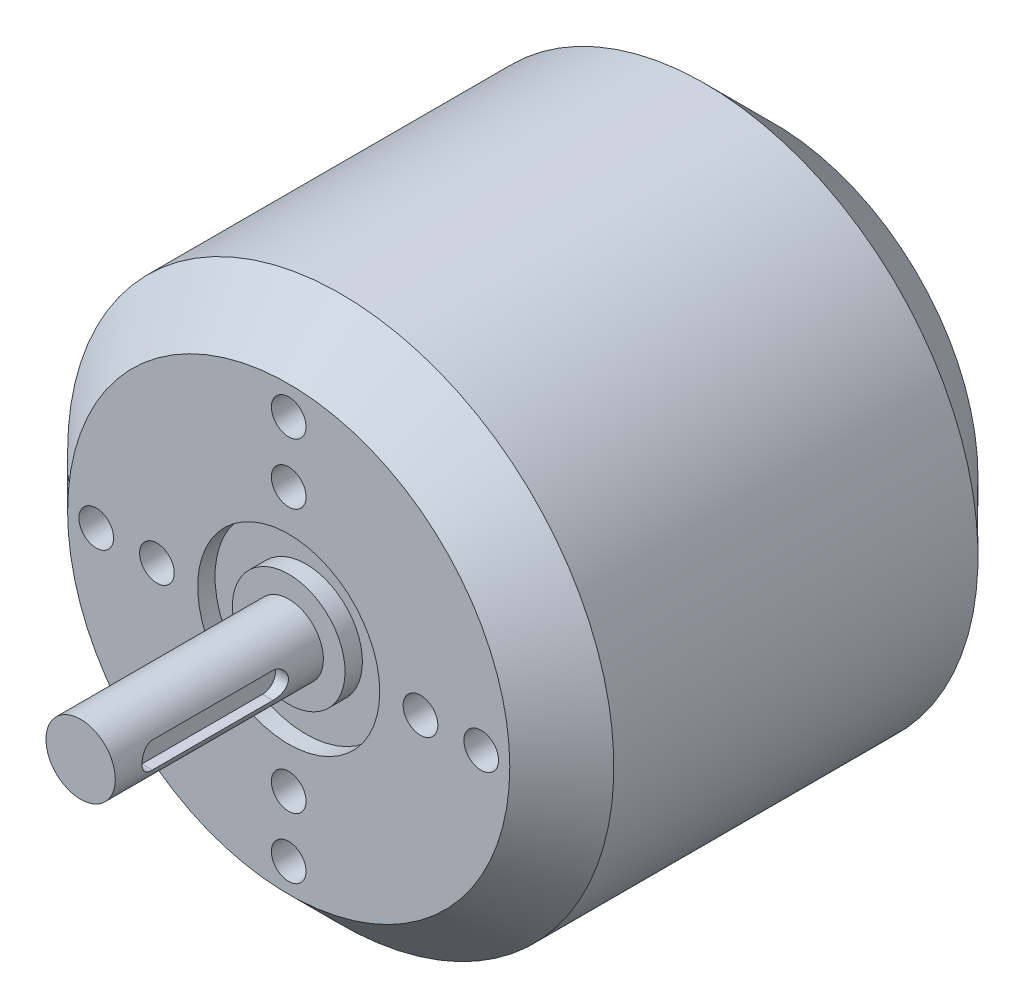
ISO-10303-21;
HEADER;
FILE_DESCRIPTION(('STEP AP214'),'2;1');
FILE_NAME('part.step','',(''),(''),'','','');
FILE_SCHEMA(('AUTOMOTIVE_DESIGN { 1 0 10303 214 1 1 1 1 }'));
ENDSEC;
DATA;
#1=APPLICATION_CONTEXT('core data for automotive mechanical design processes');
#2=APPLICATION_PROTOCOL_DEFINITION('international standard','automotive_design',2000,#1);
#3=PRODUCT_CONTEXT('',#1,'mechanical');
#4=PRODUCT('Part','Part','',(#3));
#5=PRODUCT_RELATED_PRODUCT_CATEGORY('part','',(#4));
#6=PRODUCT_DEFINITION_FORMATION('','',#4);
#7=PRODUCT_DEFINITION_CONTEXT('part definition',#1,'design');
#8=PRODUCT_DEFINITION('design','',#6,#7);
#9=PRODUCT_DEFINITION_SHAPE('','',#8);
#10=(LENGTH_UNIT() NAMED_UNIT(*) SI_UNIT(.MILLI.,.METRE.));
#11=(NAMED_UNIT(*) PLANE_ANGLE_UNIT() SI_UNIT($,.RADIAN.));
#12=(NAMED_UNIT(*) SI_UNIT($,.STERADIAN.) SOLID_ANGLE_UNIT());
#13=UNCERTAINTY_MEASURE_WITH_UNIT(LENGTH_MEASURE(1.E-05),#10,'distance_accuracy_value','');
#14=(GEOMETRIC_REPRESENTATION_CONTEXT(3) GLOBAL_UNCERTAINTY_ASSIGNED_CONTEXT((#13)) GLOBAL_UNIT_ASSIGNED_CONTEXT((#10,
#11,#12)) REPRESENTATION_CONTEXT('',''));
#15=CARTESIAN_POINT('',(0.,0.,0.));
#16=DIRECTION('',(0.,0.,1.));
#17=DIRECTION('',(1.,0.,0.));
#18=AXIS2_PLACEMENT_3D('',#15,#16,#17);
#19=CARTESIAN_POINT('',(0.,0.,42.));
#20=DIRECTION('',(0.,0.,-1.));
#21=DIRECTION('',(-1.,0.,0.));
#22=AXIS2_PLACEMENT_3D('',#19,#20,#21);
#23=CYLINDRICAL_SURFACE('',#22,31.5);
#24=CARTESIAN_POINT('',(0.,0.,0.));
#25=DIRECTION('',(0.,0.,-1.));
#26=DIRECTION('',(-1.,0.,0.));
#27=AXIS2_PLACEMENT_3D('',#24,#25,#26);
#28=CIRCLE('',#27,31.5);
#29=CARTESIAN_POINT('',(-31.5,0.,0.));
#30=VERTEX_POINT('',#29);
#31=EDGE_CURVE('E178',#30,#30,#28,.F.);
#32=CARTESIAN_POINT('',(0.,0.,42.));
#33=DIRECTION('',(0.,0.,1.));
#34=DIRECTION('',(1.,0.,0.));
#35=AXIS2_PLACEMENT_3D('',#32,#33,#34);
#36=CIRCLE('',#35,31.5);
#37=CARTESIAN_POINT('',(-31.5,0.,42.));
#38=VERTEX_POINT('',#37);
#39=EDGE_CURVE('E181',#38,#38,#36,.F.);
#40=CARTESIAN_POINT('',(-31.5,0.,0.));
#41=CARTESIAN_POINT('',(-31.5,0.,0.4375));
#42=CARTESIAN_POINT('',(-31.5,0.,0.875000000000001));
#43=CARTESIAN_POINT('',(-31.5,0.,1.75));
#44=CARTESIAN_POINT('',(-31.5,0.,2.1875));
#45=CARTESIAN_POINT('',(-31.5,0.,3.0625));
#46=CARTESIAN_POINT('',(-31.5,0.,3.5));
#47=CARTESIAN_POINT('',(-31.5,0.,4.375));
#48=CARTESIAN_POINT('',(-31.5,0.,4.8125));
#49=CARTESIAN_POINT('',(-31.5,0.,5.6875));
#50=CARTESIAN_POINT('',(-31.5,0.,6.125));
#51=CARTESIAN_POINT('',(-31.5,0.,7.));
#52=CARTESIAN_POINT('',(-31.5,0.,7.4375));
#53=CARTESIAN_POINT('',(-31.5,0.,8.3125));
#54=CARTESIAN_POINT('',(-31.5,0.,8.75));
#55=CARTESIAN_POINT('',(-31.5,0.,9.625));
#56=CARTESIAN_POINT('',(-31.5,0.,10.0625));
#57=CARTESIAN_POINT('',(-31.5,0.,10.9375));
#58=CARTESIAN_POINT('',(-31.5,0.,11.375));
#59=CARTESIAN_POINT('',(-31.5,0.,12.25));
#60=CARTESIAN_POINT('',(-31.5,0.,12.6875));
#61=CARTESIAN_POINT('',(-31.5,0.,13.5625));
#62=CARTESIAN_POINT('',(-31.5,0.,14.));
#63=CARTESIAN_POINT('',(-31.5,0.,14.875));
#64=CARTESIAN_POINT('',(-31.5,0.,15.3125));
#65=CARTESIAN_POINT('',(-31.5,0.,16.1875));
#66=CARTESIAN_POINT('',(-31.5,0.,16.625));
#67=CARTESIAN_POINT('',(-31.5,0.,17.5));
#68=CARTESIAN_POINT('',(-31.5,0.,17.9375));
#69=CARTESIAN_POINT('',(-31.5,0.,18.8125));
#70=CARTESIAN_POINT('',(-31.5,0.,19.25));
#71=CARTESIAN_POINT('',(-31.5,0.,20.125));
#72=CARTESIAN_POINT('',(-31.5,0.,20.5625));
#73=CARTESIAN_POINT('',(-31.5,0.,21.4375));
#74=CARTESIAN_POINT('',(-31.5,0.,21.875));
#75=CARTESIAN_POINT('',(-31.5,0.,22.75));
#76=CARTESIAN_POINT('',(-31.5,0.,23.1875));
#77=CARTESIAN_POINT('',(-31.5,0.,24.0625));
#78=CARTESIAN_POINT('',(-31.5,0.,24.5));
#79=CARTESIAN_POINT('',(-31.5,0.,25.375));
#80=CARTESIAN_POINT('',(-31.5,0.,25.8125));
#81=CARTESIAN_POINT('',(-31.5,0.,26.6875));
#82=CARTESIAN_POINT('',(-31.5,0.,27.125));
#83=CARTESIAN_POINT('',(-31.5,0.,28.));
#84=CARTESIAN_POINT('',(-31.5,0.,28.4375));
#85=CARTESIAN_POINT('',(-31.5,0.,29.3125));
#86=CARTESIAN_POINT('',(-31.5,0.,29.75));
#87=CARTESIAN_POINT('',(-31.5,0.,30.625));
#88=CARTESIAN_POINT('',(-31.5,0.,31.0625));
#89=CARTESIAN_POINT('',(-31.5,0.,31.9375));
#90=CARTESIAN_POINT('',(-31.5,0.,32.375));
#91=CARTESIAN_POINT('',(-31.5,0.,33.25));
#92=CARTESIAN_POINT('',(-31.5,0.,33.6875));
#93=CARTESIAN_POINT('',(-31.5,0.,34.5625));
#94=CARTESIAN_POINT('',(-31.5,0.,35.));
#95=CARTESIAN_POINT('',(-31.5,0.,35.875));
#96=CARTESIAN_POINT('',(-31.5,0.,36.3125));
#97=CARTESIAN_POINT('',(-31.5,0.,37.1875));
#98=CARTESIAN_POINT('',(-31.5,0.,37.625));
#99=CARTESIAN_POINT('',(-31.5,0.,38.5));
#100=CARTESIAN_POINT('',(-31.5,0.,38.9375));
#101=CARTESIAN_POINT('',(-31.5,0.,39.8125));
#102=CARTESIAN_POINT('',(-31.5,0.,40.25));
#103=CARTESIAN_POINT('',(-31.5,0.,41.125));
#104=CARTESIAN_POINT('',(-31.5,0.,41.5625));
#105=CARTESIAN_POINT('',(-31.5,0.,42.));
#106=B_SPLINE_CURVE_WITH_KNOTS('',3,(#40,#41,#42,#43,#44,#45,#46,#47,#48,#49,#50,#51,#52,#53,
#54,#55,#56,#57,#58,#59,#60,#61,#62,#63,#64,#65,#66,#67,#68,#69,#70,#71,#72,#73,#74,#75,#76,#77,
#78,#79,#80,#81,#82,#83,#84,#85,#86,#87,#88,#89,#90,#91,#92,#93,#94,#95,#96,#97,#98,#99,#100,
#101,#102,#103,#104,#105),.UNSPECIFIED.,.F.,.F.,(4,2,2,2,2,2,2,2,2,2,2,2,2,2,2,2,2,2,2,2,2,2,2,
2,2,2,2,2,2,2,2,2,4),(0.,1.3125,2.625,3.9375,5.25,6.5625,7.875,9.1875,10.5,11.8125,13.125,
14.4375,15.75,17.0625,18.375,19.6875,21.,22.3125,23.625,24.9375,26.25,27.5625,28.875,30.1875,
31.5,32.8125,34.125,35.4375,36.75,38.0625,39.375,40.6875,42.),.UNSPECIFIED.);
#107=EDGE_CURVE('BSEAM38',#30,#38,#106,.T.);
#108=ORIENTED_EDGE('',*,*,#31,.T.);
#109=ORIENTED_EDGE('',*,*,#39,.T.);
#110=ORIENTED_EDGE('',*,*,#107,.T.);
#111=ORIENTED_EDGE('',*,*,#107,.F.);
#112=EDGE_LOOP('',(#108,#110,#109,#111));
#113=FACE_BOUND('',#112,.T.);
#114=ADVANCED_FACE('F38',(#113),#23,.T.);
#115=CARTESIAN_POINT('',(0.,0.,48.));
#116=DIRECTION('',(0.,0.,1.));
#117=DIRECTION('',(1.,0.,0.));
#118=AXIS2_PLACEMENT_3D('',#115,#116,#117);
#119=PLANE('',#118);
#120=CARTESIAN_POINT('',(0.,0.,48.));
#121=DIRECTION('',(0.,0.,1.));
#122=DIRECTION('',(1.,0.,0.));
#123=AXIS2_PLACEMENT_3D('',#120,#121,#122);
#124=CIRCLE('',#123,10.5);
#125=CARTESIAN_POINT('',(10.5,0.,48.));
#126=VERTEX_POINT('',#125);
#127=EDGE_CURVE('E107',#126,#126,#124,.T.);
#128=ORIENTED_EDGE('',*,*,#127,.F.);
#129=EDGE_LOOP('',(#128));
#130=FACE_BOUND('',#129,.T.);
#131=CARTESIAN_POINT('',(2.10232574252353E-12,-15.2,48.));
#132=DIRECTION('',(0.,0.,1.));
#133=DIRECTION('',(1.,0.,0.));
#134=AXIS2_PLACEMENT_3D('',#131,#132,#133);
#135=CIRCLE('',#134,2.00000000000211);
#136=CARTESIAN_POINT('',(2.00000000000421,-15.2,48.));
#137=VERTEX_POINT('',#136);
#138=EDGE_CURVE('E120',#137,#137,#135,.T.);
#139=ORIENTED_EDGE('',*,*,#138,.F.);
#140=EDGE_LOOP('',(#139));
#141=FACE_BOUND('',#140,.T.);
#142=CARTESIAN_POINT('',(22.200000000001,1.05159149764147E-12,48.));
#143=DIRECTION('',(0.,0.,1.));
#144=DIRECTION('',(1.,0.,0.));
#145=AXIS2_PLACEMENT_3D('',#142,#143,#144);
#146=CIRCLE('',#145,2.00000000000077);
#147=CARTESIAN_POINT('',(24.2000000000018,1.05159149764147E-12,48.));
#148=VERTEX_POINT('',#147);
#149=EDGE_CURVE('E139',#148,#148,#146,.T.);
#150=ORIENTED_EDGE('',*,*,#149,.F.);
#151=EDGE_LOOP('',(#150));
#152=FACE_BOUND('',#151,.T.);
#153=CARTESIAN_POINT('',(15.2000000000011,1.05116287126176E-12,48.));
#154=DIRECTION('',(0.,0.,1.));
#155=DIRECTION('',(1.,0.,0.));
#156=AXIS2_PLACEMENT_3D('',#153,#154,#155);
#157=CIRCLE('',#156,2.00000000000075);
#158=CARTESIAN_POINT('',(17.2000000000018,1.05116287126176E-12,48.));
#159=VERTEX_POINT('',#158);
#160=EDGE_CURVE('E138',#159,#159,#157,.T.);
#161=ORIENTED_EDGE('',*,*,#160,.F.);
#162=EDGE_LOOP('',(#161));
#163=FACE_BOUND('',#162,.T.);
#164=CARTESIAN_POINT('',(0.,22.2,48.));
#165=DIRECTION('',(0.,0.,1.));
#166=DIRECTION('',(1.,0.,0.));
#167=AXIS2_PLACEMENT_3D('',#164,#165,#166);
#168=CIRCLE('',#167,2.);
#169=CARTESIAN_POINT('',(2.,22.2,48.));
#170=VERTEX_POINT('',#169);
#171=EDGE_CURVE('E151',#170,#170,#168,.T.);
#172=ORIENTED_EDGE('',*,*,#171,.F.);
#173=EDGE_LOOP('',(#172));
#174=FACE_BOUND('',#173,.T.);
#175=CARTESIAN_POINT('',(2.10318299528293E-12,-22.2,48.));
#176=DIRECTION('',(0.,0.,1.));
#177=DIRECTION('',(1.,0.,0.));
#178=AXIS2_PLACEMENT_3D('',#175,#176,#177);
#179=CIRCLE('',#178,2.00000000000216);
#180=CARTESIAN_POINT('',(2.00000000000426,-22.2,48.));
#181=VERTEX_POINT('',#180);
#182=EDGE_CURVE('E121',#181,#181,#179,.T.);
#183=ORIENTED_EDGE('',*,*,#182,.F.);
#184=EDGE_LOOP('',(#183));
#185=FACE_BOUND('',#184,.T.);
#186=CARTESIAN_POINT('',(-15.199999999999,-1.05302433439647E-12,48.));
#187=DIRECTION('',(0.,0.,1.));
#188=DIRECTION('',(1.,0.,0.));
#189=AXIS2_PLACEMENT_3D('',#186,#187,#188);
#190=CIRCLE('',#189,2.00000000000147);
#191=CARTESIAN_POINT('',(-13.1999999999975,-1.05302433439647E-12,48.));
#192=VERTEX_POINT('',#191);
#193=EDGE_CURVE('E127',#192,#192,#190,.T.);
#194=ORIENTED_EDGE('',*,*,#193,.F.);
#195=EDGE_LOOP('',(#194));
#196=FACE_BOUND('',#195,.T.);
#197=CARTESIAN_POINT('',(-22.199999999999,-1.05431021353557E-12,48.));
#198=DIRECTION('',(0.,0.,1.));
#199=DIRECTION('',(1.,0.,0.));
#200=AXIS2_PLACEMENT_3D('',#197,#198,#199);
#201=CIRCLE('',#200,2.00000000000154);
#202=CARTESIAN_POINT('',(-20.1999999999974,-1.05431021353557E-12,48.));
#203=VERTEX_POINT('',#202);
#204=EDGE_CURVE('E89',#203,#203,#201,.T.);
#205=ORIENTED_EDGE('',*,*,#204,.F.);
#206=EDGE_LOOP('',(#205));
#207=FACE_BOUND('',#206,.T.);
#208=CARTESIAN_POINT('',(0.,15.2,48.));
#209=DIRECTION('',(0.,0.,1.));
#210=DIRECTION('',(1.,0.,0.));
#211=AXIS2_PLACEMENT_3D('',#208,#209,#210);
#212=CIRCLE('',#211,2.);
#213=CARTESIAN_POINT('',(2.,15.2,48.));
#214=VERTEX_POINT('',#213);
#215=EDGE_CURVE('E150',#214,#214,#212,.T.);
#216=ORIENTED_EDGE('',*,*,#215,.F.);
#217=EDGE_LOOP('',(#216));
#218=FACE_BOUND('',#217,.T.);
#219=CARTESIAN_POINT('',(0.,0.,48.));
#220=DIRECTION('',(0.,0.,1.));
#221=DIRECTION('',(1.,0.,0.));
#222=AXIS2_PLACEMENT_3D('',#219,#220,#221);
#223=CIRCLE('',#222,25.5);
#224=CARTESIAN_POINT('',(25.5,0.,48.));
#225=VERTEX_POINT('',#224);
#226=EDGE_CURVE('E175',#225,#225,#223,.T.);
#227=ORIENTED_EDGE('',*,*,#226,.T.);
#228=EDGE_LOOP('',(#227));
#229=FACE_BOUND('',#228,.T.);
#230=ADVANCED_FACE('F286',(#130,#141,#152,#163,#174,#185,#196,#207,#218,#229),#119,.T.);
#231=CARTESIAN_POINT('',(0.,0.,48.));
#232=DIRECTION('',(0.,0.,-1.));
#233=DIRECTION('',(-1.,0.,0.));
#234=AXIS2_PLACEMENT_3D('',#231,#232,#233);
#235=CONICAL_SURFACE('',#234,25.5,0.785398163397448);
#236=ORIENTED_EDGE('',*,*,#39,.F.);
#237=EDGE_LOOP('',(#236));
#238=FACE_BOUND('',#237,.T.);
#239=ORIENTED_EDGE('',*,*,#226,.F.);
#240=EDGE_LOOP('',(#239));
#241=FACE_BOUND('',#240,.T.);
#242=ADVANCED_FACE('F292',(#238,#241),#235,.T.);
#243=CARTESIAN_POINT('',(0.,0.,-8.));
#244=DIRECTION('',(0.,0.,-1.));
#245=DIRECTION('',(-1.,0.,0.));
#246=AXIS2_PLACEMENT_3D('',#243,#244,#245);
#247=PLANE('',#246);
#248=CARTESIAN_POINT('',(0.,0.,-8.));
#249=DIRECTION('',(0.,0.,-1.));
#250=DIRECTION('',(-1.,0.,0.));
#251=AXIS2_PLACEMENT_3D('',#248,#249,#250);
#252=CIRCLE('',#251,7.5);
#253=CARTESIAN_POINT('',(-7.5,0.,-8.));
#254=VERTEX_POINT('',#253);
#255=EDGE_CURVE('E172',#254,#254,#252,.T.);
#256=ORIENTED_EDGE('',*,*,#255,.F.);
#257=EDGE_LOOP('',(#256));
#258=FACE_BOUND('',#257,.T.);
#259=CARTESIAN_POINT('',(0.,0.,-8.));
#260=DIRECTION('',(0.,0.,-1.));
#261=DIRECTION('',(-1.,0.,0.));
#262=AXIS2_PLACEMENT_3D('',#259,#260,#261);
#263=CIRCLE('',#262,23.5);
#264=CARTESIAN_POINT('',(-23.5,0.,-8.));
#265=VERTEX_POINT('',#264);
#266=EDGE_CURVE('E184',#265,#265,#263,.T.);
#267=ORIENTED_EDGE('',*,*,#266,.T.);
#268=EDGE_LOOP('',(#267));
#269=FACE_BOUND('',#268,.T.);
#270=ADVANCED_FACE('F298',(#258,#269),#247,.T.);
#271=CARTESIAN_POINT('',(0.,0.,-8.));
#272=DIRECTION('',(0.,0.,1.));
#273=DIRECTION('',(1.,0.,0.));
#274=AXIS2_PLACEMENT_3D('',#271,#272,#273);
#275=CONICAL_SURFACE('',#274,23.5,0.785398163397448);
#276=ORIENTED_EDGE('',*,*,#31,.F.);
#277=EDGE_LOOP('',(#276));
#278=FACE_BOUND('',#277,.T.);
#279=ORIENTED_EDGE('',*,*,#266,.F.);
#280=EDGE_LOOP('',(#279));
#281=FACE_BOUND('',#280,.T.);
#282=ADVANCED_FACE('F40',(#278,#281),#275,.T.);
#283=CARTESIAN_POINT('',(0.,0.,-9.));
#284=DIRECTION('',(0.,0.,1.));
#285=DIRECTION('',(1.,0.,0.));
#286=AXIS2_PLACEMENT_3D('',#283,#284,#285);
#287=CYLINDRICAL_SURFACE('',#286,7.5);
#288=CARTESIAN_POINT('',(0.,0.,-9.));
#289=DIRECTION('',(0.,0.,-1.));
#290=DIRECTION('',(-1.,0.,0.));
#291=AXIS2_PLACEMENT_3D('',#288,#289,#290);
#292=CIRCLE('',#291,7.5);
#293=CARTESIAN_POINT('',(-7.5,0.,-9.));
#294=VERTEX_POINT('',#293);
#295=EDGE_CURVE('E167',#294,#294,#292,.T.);
#296=ORIENTED_EDGE('',*,*,#295,.F.);
#297=EDGE_LOOP('',(#296));
#298=FACE_BOUND('',#297,.T.);
#299=ORIENTED_EDGE('',*,*,#255,.T.);
#300=EDGE_LOOP('',(#299));
#301=FACE_BOUND('',#300,.T.);
#302=ADVANCED_FACE('F311',(#298,#301),#287,.T.);
#303=CARTESIAN_POINT('',(0.,0.,-9.));
#304=DIRECTION('',(0.,0.,-1.));
#305=DIRECTION('',(-1.,0.,0.));
#306=AXIS2_PLACEMENT_3D('',#303,#304,#305);
#307=PLANE('',#306);
#308=ORIENTED_EDGE('',*,*,#295,.T.);
#309=EDGE_LOOP('',(#308));
#310=FACE_BOUND('',#309,.T.);
#311=ADVANCED_FACE('F276',(#310),#307,.T.);
#312=CARTESIAN_POINT('',(0.,15.2,40.));
#313=DIRECTION('',(0.,0.,1.));
#314=DIRECTION('',(1.,0.,0.));
#315=AXIS2_PLACEMENT_3D('',#312,#313,#314);
#316=CYLINDRICAL_SURFACE('',#315,2.);
#317=CARTESIAN_POINT('',(0.,15.2,40.));
#318=DIRECTION('',(0.,0.,1.));
#319=DIRECTION('',(1.,0.,0.));
#320=AXIS2_PLACEMENT_3D('',#317,#318,#319);
#321=CIRCLE('',#320,2.);
#322=CARTESIAN_POINT('',(2.,15.2,40.));
#323=VERTEX_POINT('',#322);
#324=EDGE_CURVE('E159',#323,#323,#321,.T.);
#325=ORIENTED_EDGE('',*,*,#324,.F.);
#326=EDGE_LOOP('',(#325));
#327=FACE_BOUND('',#326,.T.);
#328=ORIENTED_EDGE('',*,*,#215,.T.);
#329=EDGE_LOOP('',(#328));
#330=FACE_BOUND('',#329,.T.);
#331=ADVANCED_FACE('F273',(#327,#330),#316,.F.);
#332=CARTESIAN_POINT('',(0.,15.2,40.));
#333=DIRECTION('',(0.,0.,1.));
#334=DIRECTION('',(1.,0.,0.));
#335=AXIS2_PLACEMENT_3D('',#332,#333,#334);
#336=PLANE('',#335);
#337=ORIENTED_EDGE('',*,*,#324,.T.);
#338=EDGE_LOOP('',(#337));
#339=FACE_BOUND('',#338,.T.);
#340=ADVANCED_FACE('F237',(#339),#336,.T.);
#341=CARTESIAN_POINT('',(-22.199999999999,-1.05431021353557E-12,40.));
#342=DIRECTION('',(0.,0.,1.));
#343=DIRECTION('',(1.,0.,0.));
#344=AXIS2_PLACEMENT_3D('',#341,#342,#343);
#345=CYLINDRICAL_SURFACE('',#344,2.00000000000154);
#346=CARTESIAN_POINT('',(-22.199999999999,-1.05431021353557E-12,40.));
#347=DIRECTION('',(0.,0.,1.));
#348=DIRECTION('',(1.,0.,0.));
#349=AXIS2_PLACEMENT_3D('',#346,#347,#348);
#350=CIRCLE('',#349,2.00000000000154);
#351=CARTESIAN_POINT('',(-20.1999999999974,-1.05431021353557E-12,40.));
#352=VERTEX_POINT('',#351);
#353=EDGE_CURVE('E130',#352,#352,#350,.T.);
#354=ORIENTED_EDGE('',*,*,#353,.F.);
#355=EDGE_LOOP('',(#354));
#356=FACE_BOUND('',#355,.T.);
#357=ORIENTED_EDGE('',*,*,#204,.T.);
#358=EDGE_LOOP('',(#357));
#359=FACE_BOUND('',#358,.T.);
#360=ADVANCED_FACE('F233',(#356,#359),#345,.F.);
#361=CARTESIAN_POINT('',(-22.199999999999,-1.05431021353557E-12,40.));
#362=DIRECTION('',(0.,0.,1.));
#363=DIRECTION('',(1.,0.,0.));
#364=AXIS2_PLACEMENT_3D('',#361,#362,#363);
#365=PLANE('',#364);
#366=ORIENTED_EDGE('',*,*,#353,.T.);
#367=EDGE_LOOP('',(#366));
#368=FACE_BOUND('',#367,.T.);
#369=ADVANCED_FACE('F229',(#368),#365,.T.);
#370=CARTESIAN_POINT('',(-15.199999999999,-1.05302433439647E-12,40.));
#371=DIRECTION('',(0.,0.,1.));
#372=DIRECTION('',(1.,0.,0.));
#373=AXIS2_PLACEMENT_3D('',#370,#371,#372);
#374=CYLINDRICAL_SURFACE('',#373,2.00000000000147);
#375=CARTESIAN_POINT('',(-15.199999999999,-1.05302433439647E-12,40.));
#376=DIRECTION('',(0.,0.,1.));
#377=DIRECTION('',(1.,0.,0.));
#378=AXIS2_PLACEMENT_3D('',#375,#376,#377);
#379=CIRCLE('',#378,2.00000000000147);
#380=CARTESIAN_POINT('',(-13.1999999999975,-1.05302433439647E-12,40.));
#381=VERTEX_POINT('',#380);
#382=EDGE_CURVE('E124',#381,#381,#379,.T.);
#383=ORIENTED_EDGE('',*,*,#382,.F.);
#384=EDGE_LOOP('',(#383));
#385=FACE_BOUND('',#384,.T.);
#386=ORIENTED_EDGE('',*,*,#193,.T.);
#387=EDGE_LOOP('',(#386));
#388=FACE_BOUND('',#387,.T.);
#389=ADVANCED_FACE('F225',(#385,#388),#374,.F.);
#390=CARTESIAN_POINT('',(-15.199999999999,-1.05302433439647E-12,40.));
#391=DIRECTION('',(0.,0.,1.));
#392=DIRECTION('',(1.,0.,0.));
#393=AXIS2_PLACEMENT_3D('',#390,#391,#392);
#394=PLANE('',#393);
#395=ORIENTED_EDGE('',*,*,#382,.T.);
#396=EDGE_LOOP('',(#395));
#397=FACE_BOUND('',#396,.T.);
#398=ADVANCED_FACE('F221',(#397),#394,.T.);
#399=CARTESIAN_POINT('',(2.10318299528293E-12,-22.2,40.));
#400=DIRECTION('',(0.,0.,1.));
#401=DIRECTION('',(1.,0.,0.));
#402=AXIS2_PLACEMENT_3D('',#399,#400,#401);
#403=CYLINDRICAL_SURFACE('',#402,2.00000000000216);
#404=CARTESIAN_POINT('',(2.10318299528293E-12,-22.2,40.));
#405=DIRECTION('',(0.,0.,1.));
#406=DIRECTION('',(1.,0.,0.));
#407=AXIS2_PLACEMENT_3D('',#404,#405,#406);
#408=CIRCLE('',#407,2.00000000000216);
#409=CARTESIAN_POINT('',(2.00000000000426,-22.2,40.));
#410=VERTEX_POINT('',#409);
#411=EDGE_CURVE('E117',#410,#410,#408,.T.);
#412=ORIENTED_EDGE('',*,*,#411,.F.);
#413=EDGE_LOOP('',(#412));
#414=FACE_BOUND('',#413,.T.);
#415=ORIENTED_EDGE('',*,*,#182,.T.);
#416=EDGE_LOOP('',(#415));
#417=FACE_BOUND('',#416,.T.);
#418=ADVANCED_FACE('F217',(#414,#417),#403,.F.);
#419=CARTESIAN_POINT('',(2.10318299528293E-12,-22.2,40.));
#420=DIRECTION('',(0.,0.,1.));
#421=DIRECTION('',(1.,0.,0.));
#422=AXIS2_PLACEMENT_3D('',#419,#420,#421);
#423=PLANE('',#422);
#424=ORIENTED_EDGE('',*,*,#411,.T.);
#425=EDGE_LOOP('',(#424));
#426=FACE_BOUND('',#425,.T.);
#427=ADVANCED_FACE('F213',(#426),#423,.T.);
#428=CARTESIAN_POINT('',(0.,22.2,40.));
#429=DIRECTION('',(0.,0.,1.));
#430=DIRECTION('',(1.,0.,0.));
#431=AXIS2_PLACEMENT_3D('',#428,#429,#430);
#432=CYLINDRICAL_SURFACE('',#431,2.);
#433=CARTESIAN_POINT('',(0.,22.2,40.));
#434=DIRECTION('',(0.,0.,1.));
#435=DIRECTION('',(1.,0.,0.));
#436=AXIS2_PLACEMENT_3D('',#433,#434,#435);
#437=CIRCLE('',#436,2.);
#438=CARTESIAN_POINT('',(2.,22.2,40.));
#439=VERTEX_POINT('',#438);
#440=EDGE_CURVE('E147',#439,#439,#437,.T.);
#441=ORIENTED_EDGE('',*,*,#440,.F.);
#442=EDGE_LOOP('',(#441));
#443=FACE_BOUND('',#442,.T.);
#444=ORIENTED_EDGE('',*,*,#171,.T.);
#445=EDGE_LOOP('',(#444));
#446=FACE_BOUND('',#445,.T.);
#447=ADVANCED_FACE('F216',(#443,#446),#432,.F.);
#448=CARTESIAN_POINT('',(0.,22.2,40.));
#449=DIRECTION('',(0.,0.,1.));
#450=DIRECTION('',(1.,0.,0.));
#451=AXIS2_PLACEMENT_3D('',#448,#449,#450);
#452=PLANE('',#451);
#453=ORIENTED_EDGE('',*,*,#440,.T.);
#454=EDGE_LOOP('',(#453));
#455=FACE_BOUND('',#454,.T.);
#456=ADVANCED_FACE('F257',(#455),#452,.T.);
#457=CARTESIAN_POINT('',(15.2000000000011,1.05116287126176E-12,40.));
#458=DIRECTION('',(0.,0.,1.));
#459=DIRECTION('',(1.,0.,0.));
#460=AXIS2_PLACEMENT_3D('',#457,#458,#459);
#461=CYLINDRICAL_SURFACE('',#460,2.00000000000075);
#462=CARTESIAN_POINT('',(15.2000000000011,1.05116287126176E-12,40.));
#463=DIRECTION('',(0.,0.,1.));
#464=DIRECTION('',(1.,0.,0.));
#465=AXIS2_PLACEMENT_3D('',#462,#463,#464);
#466=CIRCLE('',#465,2.00000000000075);
#467=CARTESIAN_POINT('',(17.2000000000018,1.05116287126176E-12,40.));
#468=VERTEX_POINT('',#467);
#469=EDGE_CURVE('E154',#468,#468,#466,.T.);
#470=ORIENTED_EDGE('',*,*,#469,.F.);
#471=EDGE_LOOP('',(#470));
#472=FACE_BOUND('',#471,.T.);
#473=ORIENTED_EDGE('',*,*,#160,.T.);
#474=EDGE_LOOP('',(#473));
#475=FACE_BOUND('',#474,.T.);
#476=ADVANCED_FACE('F260',(#472,#475),#461,.F.);
#477=CARTESIAN_POINT('',(15.2000000000011,1.05116287126176E-12,40.));
#478=DIRECTION('',(0.,0.,1.));
#479=DIRECTION('',(1.,0.,0.));
#480=AXIS2_PLACEMENT_3D('',#477,#478,#479);
#481=PLANE('',#480);
#482=ORIENTED_EDGE('',*,*,#469,.T.);
#483=EDGE_LOOP('',(#482));
#484=FACE_BOUND('',#483,.T.);
#485=ADVANCED_FACE('F247',(#484),#481,.T.);
#486=CARTESIAN_POINT('',(22.200000000001,1.05159149764147E-12,40.));
#487=DIRECTION('',(0.,0.,1.));
#488=DIRECTION('',(1.,0.,0.));
#489=AXIS2_PLACEMENT_3D('',#486,#487,#488);
#490=CYLINDRICAL_SURFACE('',#489,2.00000000000077);
#491=CARTESIAN_POINT('',(22.200000000001,1.05159149764147E-12,40.));
#492=DIRECTION('',(0.,0.,1.));
#493=DIRECTION('',(1.,0.,0.));
#494=AXIS2_PLACEMENT_3D('',#491,#492,#493);
#495=CIRCLE('',#494,2.00000000000077);
#496=CARTESIAN_POINT('',(24.2000000000018,1.05159149764147E-12,40.));
#497=VERTEX_POINT('',#496);
#498=EDGE_CURVE('E135',#497,#497,#495,.T.);
#499=ORIENTED_EDGE('',*,*,#498,.F.);
#500=EDGE_LOOP('',(#499));
#501=FACE_BOUND('',#500,.T.);
#502=ORIENTED_EDGE('',*,*,#149,.T.);
#503=EDGE_LOOP('',(#502));
#504=FACE_BOUND('',#503,.T.);
#505=ADVANCED_FACE('F243',(#501,#504),#490,.F.);
#506=CARTESIAN_POINT('',(22.200000000001,1.05159149764147E-12,40.));
#507=DIRECTION('',(0.,0.,1.));
#508=DIRECTION('',(1.,0.,0.));
#509=AXIS2_PLACEMENT_3D('',#506,#507,#508);
#510=PLANE('',#509);
#511=ORIENTED_EDGE('',*,*,#498,.T.);
#512=EDGE_LOOP('',(#511));
#513=FACE_BOUND('',#512,.T.);
#514=ADVANCED_FACE('F239',(#513),#510,.T.);
#515=CARTESIAN_POINT('',(2.10232574252353E-12,-15.2,40.));
#516=DIRECTION('',(0.,0.,1.));
#517=DIRECTION('',(1.,0.,0.));
#518=AXIS2_PLACEMENT_3D('',#515,#516,#517);
#519=CYLINDRICAL_SURFACE('',#518,2.00000000000211);
#520=CARTESIAN_POINT('',(2.10232574252353E-12,-15.2,40.));
#521=DIRECTION('',(0.,0.,1.));
#522=DIRECTION('',(1.,0.,0.));
#523=AXIS2_PLACEMENT_3D('',#520,#521,#522);
#524=CIRCLE('',#523,2.00000000000211);
#525=CARTESIAN_POINT('',(2.00000000000421,-15.2,40.));
#526=VERTEX_POINT('',#525);
#527=EDGE_CURVE('E142',#526,#526,#524,.T.);
#528=ORIENTED_EDGE('',*,*,#527,.F.);
#529=EDGE_LOOP('',(#528));
#530=FACE_BOUND('',#529,.T.);
#531=ORIENTED_EDGE('',*,*,#138,.T.);
#532=EDGE_LOOP('',(#531));
#533=FACE_BOUND('',#532,.T.);
#534=ADVANCED_FACE('F242',(#530,#533),#519,.F.);
#535=CARTESIAN_POINT('',(2.10232574252353E-12,-15.2,40.));
#536=DIRECTION('',(0.,0.,1.));
#537=DIRECTION('',(1.,0.,0.));
#538=AXIS2_PLACEMENT_3D('',#535,#536,#537);
#539=PLANE('',#538);
#540=ORIENTED_EDGE('',*,*,#527,.T.);
#541=EDGE_LOOP('',(#540));
#542=FACE_BOUND('',#541,.T.);
#543=ADVANCED_FACE('F249',(#542),#539,.T.);
#544=CARTESIAN_POINT('',(0.,0.,46.));
#545=DIRECTION('',(0.,0.,1.));
#546=DIRECTION('',(1.,0.,0.));
#547=AXIS2_PLACEMENT_3D('',#544,#545,#546);
#548=CYLINDRICAL_SURFACE('',#547,10.5);
#549=CARTESIAN_POINT('',(0.,0.,46.));
#550=DIRECTION('',(0.,0.,1.));
#551=DIRECTION('',(1.,0.,0.));
#552=AXIS2_PLACEMENT_3D('',#549,#550,#551);
#553=CIRCLE('',#552,10.5);
#554=CARTESIAN_POINT('',(10.5,0.,46.));
#555=VERTEX_POINT('',#554);
#556=EDGE_CURVE('E104',#555,#555,#553,.T.);
#557=ORIENTED_EDGE('',*,*,#556,.F.);
#558=EDGE_LOOP('',(#557));
#559=FACE_BOUND('',#558,.T.);
#560=ORIENTED_EDGE('',*,*,#127,.T.);
#561=EDGE_LOOP('',(#560));
#562=FACE_BOUND('',#561,.T.);
#563=ADVANCED_FACE('F252',(#559,#562),#548,.F.);
#564=CARTESIAN_POINT('',(0.,0.,46.));
#565=DIRECTION('',(0.,0.,1.));
#566=DIRECTION('',(1.,0.,0.));
#567=AXIS2_PLACEMENT_3D('',#564,#565,#566);
#568=PLANE('',#567);
#569=CARTESIAN_POINT('',(0.,0.,46.));
#570=DIRECTION('',(0.,0.,1.));
#571=DIRECTION('',(1.,0.,0.));
#572=AXIS2_PLACEMENT_3D('',#569,#570,#571);
#573=CIRCLE('',#572,6.5);
#574=CARTESIAN_POINT('',(6.5,0.,46.));
#575=VERTEX_POINT('',#574);
#576=EDGE_CURVE('E601',#575,#575,#573,.T.);
#577=ORIENTED_EDGE('',*,*,#576,.F.);
#578=EDGE_LOOP('',(#577));
#579=FACE_BOUND('',#578,.T.);
#580=ORIENTED_EDGE('',*,*,#556,.T.);
#581=EDGE_LOOP('',(#580));
#582=FACE_BOUND('',#581,.T.);
#583=ADVANCED_FACE('F397',(#579,#582),#568,.T.);
#584=CARTESIAN_POINT('',(0.,0.,46.));
#585=DIRECTION('',(0.,0.,1.));
#586=DIRECTION('',(1.,0.,0.));
#587=AXIS2_PLACEMENT_3D('',#584,#585,#586);
#588=CYLINDRICAL_SURFACE('',#587,6.5);
#589=ORIENTED_EDGE('',*,*,#576,.T.);
#590=EDGE_LOOP('',(#589));
#591=FACE_BOUND('',#590,.T.);
#592=CARTESIAN_POINT('',(0.,0.,48.));
#593=DIRECTION('',(0.,0.,1.));
#594=DIRECTION('',(1.,0.,0.));
#595=AXIS2_PLACEMENT_3D('',#592,#593,#594);
#596=CIRCLE('',#595,6.5);
#597=CARTESIAN_POINT('',(6.5,0.,48.));
#598=VERTEX_POINT('',#597);
#599=EDGE_CURVE('E599',#598,#598,#596,.T.);
#600=ORIENTED_EDGE('',*,*,#599,.F.);
#601=EDGE_LOOP('',(#600));
#602=FACE_BOUND('',#601,.T.);
#603=ADVANCED_FACE('F406',(#591,#602),#588,.T.);
#604=CARTESIAN_POINT('',(2.5,0.,67.4185376928396));
#605=DIRECTION('',(1.,0.,0.));
#606=DIRECTION('',(0.,0.,-1.));
#607=AXIS2_PLACEMENT_3D('',#604,#605,#606);
#608=PLANE('',#607);
#609=CARTESIAN_POINT('',(2.5,0.,67.4185376928396));
#610=DIRECTION('',(1.,0.,0.));
#611=DIRECTION('',(0.,0.,-1.));
#612=AXIS2_PLACEMENT_3D('',#609,#610,#611);
#613=CIRCLE('',#612,1.5);
#614=CARTESIAN_POINT('',(2.5,1.5,67.4185376928396));
#615=VERTEX_POINT('',#614);
#616=CARTESIAN_POINT('',(2.5,-1.5,67.4185376928396));
#617=VERTEX_POINT('',#616);
#618=EDGE_CURVE('E86',#615,#617,#613,.T.);
#619=ORIENTED_EDGE('',*,*,#618,.T.);
#620=DIRECTION('',(0.,0.,-1.));
#621=VECTOR('',#620,1.);
#622=CARTESIAN_POINT('',(2.5,-1.5,67.4185376928396));
#623=LINE('',#622,#621);
#624=CARTESIAN_POINT('',(2.5,-1.5,53.5270847484594));
#625=VERTEX_POINT('',#624);
#626=EDGE_CURVE('E93',#617,#625,#623,.T.);
#627=ORIENTED_EDGE('',*,*,#626,.T.);
#628=CARTESIAN_POINT('',(2.5,0.,53.5270847484594));
#629=DIRECTION('',(1.,0.,0.));
#630=DIRECTION('',(0.,0.,-1.));
#631=AXIS2_PLACEMENT_3D('',#628,#629,#630);
#632=CIRCLE('',#631,1.5);
#633=CARTESIAN_POINT('',(2.5,1.5,53.5270847484594));
#634=VERTEX_POINT('',#633);
#635=EDGE_CURVE('E99',#625,#634,#632,.T.);
#636=ORIENTED_EDGE('',*,*,#635,.T.);
#637=DIRECTION('',(0.,0.,1.));
#638=VECTOR('',#637,1.);
#639=CARTESIAN_POINT('',(2.5,1.5,67.4185376928396));
#640=LINE('',#639,#638);
#641=EDGE_CURVE('E103',#634,#615,#640,.T.);
#642=ORIENTED_EDGE('',*,*,#641,.T.);
#643=EDGE_LOOP('',(#619,#627,#636,#642));
#644=FACE_BOUND('',#643,.T.);
#645=ADVANCED_FACE('F102',(#644),#608,.T.);
#646=CARTESIAN_POINT('',(12.5,-1.5,67.4185376928396));
#647=DIRECTION('',(0.,1.,0.));
#648=DIRECTION('',(0.,0.,1.));
#649=AXIS2_PLACEMENT_3D('',#646,#647,#648);
#650=PLANE('',#649);
#651=DIRECTION('',(0.,0.,-1.));
#652=VECTOR('',#651,1.);
#653=CARTESIAN_POINT('',(3.70809924354783,-1.5,72.));
#654=LINE('',#653,#652);
#655=CARTESIAN_POINT('',(3.70809924354783,-1.5,67.4185376928396));
#656=VERTEX_POINT('',#655);
#657=CARTESIAN_POINT('',(3.70809924354783,-1.5,53.5270847484594));
#658=VERTEX_POINT('',#657);
#659=EDGE_CURVE('E52',#656,#658,#654,.T.);
#660=ORIENTED_EDGE('',*,*,#659,.T.);
#661=DIRECTION('',(-1.,0.,0.));
#662=VECTOR('',#661,1.);
#663=CARTESIAN_POINT('',(12.5,-1.5,53.5270847484594));
#664=LINE('',#663,#662);
#665=EDGE_CURVE('E90',#658,#625,#664,.T.);
#666=ORIENTED_EDGE('',*,*,#665,.T.);
#667=ORIENTED_EDGE('',*,*,#626,.F.);
#668=DIRECTION('',(-1.,0.,0.));
#669=VECTOR('',#668,1.);
#670=CARTESIAN_POINT('',(12.5,-1.5,67.4185376928396));
#671=LINE('',#670,#669);
#672=EDGE_CURVE('E82',#656,#617,#671,.T.);
#673=ORIENTED_EDGE('',*,*,#672,.F.);
#674=EDGE_LOOP('',(#660,#666,#667,#673));
#675=FACE_BOUND('',#674,.T.);
#676=ADVANCED_FACE('F94',(#675),#650,.T.);
#677=CARTESIAN_POINT('',(12.5,0.,53.5270847484594));
#678=DIRECTION('',(-1.,0.,0.));
#679=DIRECTION('',(0.,0.,1.));
#680=AXIS2_PLACEMENT_3D('',#677,#678,#679);
#681=CYLINDRICAL_SURFACE('',#680,1.5);
#682=CARTESIAN_POINT('',(3.70809924354783,-1.5,53.5270847484594));
#683=CARTESIAN_POINT('',(3.70809443619348,-1.50000149729856,53.4864922154298));
#684=CARTESIAN_POINT('',(3.70876663375751,-1.49835118206537,53.4459208191717));
#685=CARTESIAN_POINT('',(3.71141673218275,-1.49177905295192,53.3651002097321));
#686=CARTESIAN_POINT('',(3.7133941946446,-1.48685833749724,53.3248508929662));
#687=CARTESIAN_POINT('',(3.72118975606221,-1.46729482367935,53.2053175327342));
#688=CARTESIAN_POINT('',(3.72887188404209,-1.44784998767984,53.1268850882323));
#689=CARTESIAN_POINT('',(3.74825217997878,-1.39690233043372,52.9747172299443));
#690=CARTESIAN_POINT('',(3.7599469632381,-1.36540966903062,52.9009779194187));
#691=CARTESIAN_POINT('',(3.7860238820009,-1.29134097725474,52.7597512283981));
#692=CARTESIAN_POINT('',(3.80040821426565,-1.24875587557702,52.692269026447));
#693=CARTESIAN_POINT('',(3.83103589828726,-1.15146603872017,52.5621928285187));
#694=CARTESIAN_POINT('',(3.84733374054252,-1.09630269892843,52.4999547341412));
#695=CARTESIAN_POINT('',(3.8794978206844,-0.976394584974257,52.385361155442));
#696=CARTESIAN_POINT('',(3.8953639745168,-0.911647960429703,52.333007584119));
#697=CARTESIAN_POINT('',(3.92552893891845,-0.771693719740038,52.2379445342058));
#698=CARTESIAN_POINT('',(3.93975598379754,-0.696204968758629,52.1956241477757));
#699=CARTESIAN_POINT('',(3.96438035322528,-0.538553622304924,52.1244328373765));
#700=CARTESIAN_POINT('',(3.97477910532575,-0.456393528521805,52.0955568989725));
#701=CARTESIAN_POINT('',(3.99018690464435,-0.291490050670587,52.0533270296378));
#702=CARTESIAN_POINT('',(3.99540906103972,-0.208924649211908,52.0393573641555));
#703=CARTESIAN_POINT('',(4.00064014015322,-0.0424658385808867,52.0253635505274));
#704=CARTESIAN_POINT('',(4.00065066686691,0.0414271540462115,52.0253351116575));
#705=CARTESIAN_POINT('',(3.99559264174045,0.203744100069408,52.0388665546884));
#706=CARTESIAN_POINT('',(3.99077535168083,0.282233282883084,52.0517542236668));
#707=CARTESIAN_POINT('',(3.97693262269583,0.435840275995115,52.0896210195716));
#708=CARTESIAN_POINT('',(3.96790694481372,0.51095789458693,52.1146008331057));
#709=CARTESIAN_POINT('',(3.94637770601049,0.656988917196577,52.1762551410552));
#710=CARTESIAN_POINT('',(3.93382542785069,0.727825198012178,52.2130945893828));
#711=CARTESIAN_POINT('',(3.90651314175191,0.862486444375064,52.2972767860325));
#712=CARTESIAN_POINT('',(3.89175241632298,0.926309119580088,52.3446229502468));
#713=CARTESIAN_POINT('',(3.86052643048223,1.04908600084313,52.4517078799505));
#714=CARTESIAN_POINT('',(3.84401196825707,1.10753779261244,52.5120091327944));
#715=CARTESIAN_POINT('',(3.81182684214318,1.21369725159035,52.6416688828372));
#716=CARTESIAN_POINT('',(3.79615651174147,1.26140069584828,52.7110309231069));
#717=CARTESIAN_POINT('',(3.7671186794103,1.34567998313248,52.8588427768732));
#718=CARTESIAN_POINT('',(3.75381153298453,1.38197861969245,52.937463154127));
#719=CARTESIAN_POINT('',(3.73171449181344,1.44059114536973,53.1002910703013));
#720=CARTESIAN_POINT('',(3.72291700934124,1.46292853893353,53.1844889533924));
#721=CARTESIAN_POINT('',(3.7140622685257,1.48519272209728,53.3124657661072));
#722=CARTESIAN_POINT('',(3.71183476402566,1.49074028414002,53.35518707798));
#723=CARTESIAN_POINT('',(3.70885093143242,1.49814308997677,53.4409588173312));
#724=CARTESIAN_POINT('',(3.70809323601798,1.50000176547338,53.4840089014888));
#725=CARTESIAN_POINT('',(3.70809924354783,1.5,53.5270847484594));
#726=B_SPLINE_CURVE_WITH_KNOTS('',3,(#682,#683,#684,#685,#686,#687,#688,#689,#690,#691,#692,
#693,#694,#695,#696,#697,#698,#699,#700,#701,#702,#703,#704,#705,#706,#707,#708,#709,#710,#711,
#712,#713,#714,#715,#716,#717,#718,#719,#720,#721,#722,#723,#724,#725),.UNSPECIFIED.,.F.,.F.,(4,
2,2,2,2,2,2,2,2,2,2,2,2,2,2,2,2,2,2,2,2,4),(0.,0.121697465666185,0.243354077586416,
0.485593064591345,0.727628221922012,0.969861938431285,1.22298027419407,1.47614754705134,
1.73793539440997,1.9996255232324,2.25002925199203,2.50035591335681,2.73829765644058,
2.97625291175452,3.21767225141682,3.45917019544674,3.71477993951631,3.97048993642583,
4.23200510445915,4.49307880432491,4.62233004062784,4.75146098044213),.UNSPECIFIED.);
#727=CARTESIAN_POINT('',(3.70809924354783,1.5,53.5270847484594));
#728=VERTEX_POINT('',#727);
#729=EDGE_CURVE('E190',#658,#728,#726,.T.);
#730=ORIENTED_EDGE('',*,*,#729,.T.);
#731=DIRECTION('',(-1.,0.,0.));
#732=VECTOR('',#731,1.);
#733=CARTESIAN_POINT('',(12.5,1.5,53.5270847484594));
#734=LINE('',#733,#732);
#735=EDGE_CURVE('E59',#728,#634,#734,.T.);
#736=ORIENTED_EDGE('',*,*,#735,.T.);
#737=ORIENTED_EDGE('',*,*,#635,.F.);
#738=ORIENTED_EDGE('',*,*,#665,.F.);
#739=EDGE_LOOP('',(#730,#736,#737,#738));
#740=FACE_BOUND('',#739,.T.);
#741=ADVANCED_FACE('F200',(#740),#681,.F.);
#742=CARTESIAN_POINT('',(12.5,1.5,67.4185376928396));
#743=DIRECTION('',(0.,-1.,0.));
#744=DIRECTION('',(0.,0.,-1.));
#745=AXIS2_PLACEMENT_3D('',#742,#743,#744);
#746=PLANE('',#745);
#747=DIRECTION('',(0.,0.,-1.));
#748=VECTOR('',#747,1.);
#749=CARTESIAN_POINT('',(3.70809924354783,1.5,72.));
#750=LINE('',#749,#748);
#751=CARTESIAN_POINT('',(3.70809924354783,1.5,67.4185376928396));
#752=VERTEX_POINT('',#751);
#753=EDGE_CURVE('E171',#728,#752,#750,.F.);
#754=ORIENTED_EDGE('',*,*,#753,.T.);
#755=DIRECTION('',(-1.,0.,0.));
#756=VECTOR('',#755,1.);
#757=CARTESIAN_POINT('',(12.5,1.5,67.4185376928396));
#758=LINE('',#757,#756);
#759=EDGE_CURVE('E113',#752,#615,#758,.T.);
#760=ORIENTED_EDGE('',*,*,#759,.T.);
#761=ORIENTED_EDGE('',*,*,#641,.F.);
#762=ORIENTED_EDGE('',*,*,#735,.F.);
#763=EDGE_LOOP('',(#754,#760,#761,#762));
#764=FACE_BOUND('',#763,.T.);
#765=ADVANCED_FACE('F205',(#764),#746,.T.);
#766=CARTESIAN_POINT('',(12.5,0.,67.4185376928396));
#767=DIRECTION('',(-1.,0.,0.));
#768=DIRECTION('',(0.,0.,1.));
#769=AXIS2_PLACEMENT_3D('',#766,#767,#768);
#770=CYLINDRICAL_SURFACE('',#769,1.5);
#771=CARTESIAN_POINT('',(3.70809924354783,1.5,67.4185376928396));
#772=CARTESIAN_POINT('',(3.70809443619348,1.50000149729856,67.4591302258692));
#773=CARTESIAN_POINT('',(3.70876663375751,1.49835118206537,67.4997016221274));
#774=CARTESIAN_POINT('',(3.71141673218275,1.49177905295192,67.5805222315669));
#775=CARTESIAN_POINT('',(3.7133941946446,1.48685833749724,67.6207715483328));
#776=CARTESIAN_POINT('',(3.72118975606221,1.46729482367934,67.7403049085649));
#777=CARTESIAN_POINT('',(3.72887188404209,1.44784998767984,67.8187373530668));
#778=CARTESIAN_POINT('',(3.74825217997878,1.39690233043372,67.9709052113547));
#779=CARTESIAN_POINT('',(3.7599469632381,1.36540966903062,68.0446445218803));
#780=CARTESIAN_POINT('',(3.7860238820009,1.29134097725474,68.1858712129009));
#781=CARTESIAN_POINT('',(3.80040821426565,1.24875587557703,68.253353414852));
#782=CARTESIAN_POINT('',(3.83103589828726,1.15146603872017,68.3834296127803));
#783=CARTESIAN_POINT('',(3.84733374054252,1.09630269892844,68.4456677071578));
#784=CARTESIAN_POINT('',(3.8794978206844,0.976394584974257,68.560261285857));
#785=CARTESIAN_POINT('',(3.8953639745168,0.911647960429704,68.61261485718));
#786=CARTESIAN_POINT('',(3.92552893891845,0.771693719740037,68.7076779070932));
#787=CARTESIAN_POINT('',(3.93975598379754,0.696204968758626,68.7499982935233));
#788=CARTESIAN_POINT('',(3.96438035322528,0.53855362230492,68.8211896039225));
#789=CARTESIAN_POINT('',(3.97477910532575,0.456393528521804,68.8500655423265));
#790=CARTESIAN_POINT('',(3.99018690464435,0.291490050670588,68.8922954116612));
#791=CARTESIAN_POINT('',(3.99540906103972,0.20892464921191,68.9062650771436));
#792=CARTESIAN_POINT('',(4.00064014015322,0.0424658385808888,68.9202588907716));
#793=CARTESIAN_POINT('',(4.00065066686691,-0.0414271540462085,68.9202873296415));
#794=CARTESIAN_POINT('',(3.99559264174046,-0.203744100069406,68.9067558866106));
#795=CARTESIAN_POINT('',(3.99077535168083,-0.282233282883082,68.8938682176322));
#796=CARTESIAN_POINT('',(3.97693262269583,-0.435840275995115,68.8560014217274));
#797=CARTESIAN_POINT('',(3.96790694481372,-0.51095789458693,68.8310216081933));
#798=CARTESIAN_POINT('',(3.94637770601049,-0.656988917196577,68.7693673002438));
#799=CARTESIAN_POINT('',(3.93382542785069,-0.727825198012178,68.7325278519162));
#800=CARTESIAN_POINT('',(3.90651314175191,-0.862486444375064,68.6483456552665));
#801=CARTESIAN_POINT('',(3.89175241632298,-0.926309119580088,68.6009994910523));
#802=CARTESIAN_POINT('',(3.86052643048223,-1.04908600084313,68.4939145613485));
#803=CARTESIAN_POINT('',(3.84401196825707,-1.10753779261244,68.4336133085046));
#804=CARTESIAN_POINT('',(3.81182684214318,-1.21369725159035,68.3039535584618));
#805=CARTESIAN_POINT('',(3.79615651174147,-1.26140069584828,68.2345915181922));
#806=CARTESIAN_POINT('',(3.7671186794103,-1.34567998313248,68.0867796644258));
#807=CARTESIAN_POINT('',(3.75381153298453,-1.38197861969245,68.008159287172));
#808=CARTESIAN_POINT('',(3.73171449181344,-1.44059114536973,67.8453313709977));
#809=CARTESIAN_POINT('',(3.72291700934124,-1.46292853893353,67.7611334879067));
#810=CARTESIAN_POINT('',(3.7140622685257,-1.48519272209728,67.6331566751918));
#811=CARTESIAN_POINT('',(3.71183476402566,-1.49074028414002,67.590435363319));
#812=CARTESIAN_POINT('',(3.70885093143242,-1.49814308997677,67.5046636239679));
#813=CARTESIAN_POINT('',(3.70809323601798,-1.50000176547338,67.4616135398102));
#814=CARTESIAN_POINT('',(3.70809924354783,-1.5,67.4185376928396));
#815=B_SPLINE_CURVE_WITH_KNOTS('',3,(#771,#772,#773,#774,#775,#776,#777,#778,#779,#780,#781,
#782,#783,#784,#785,#786,#787,#788,#789,#790,#791,#792,#793,#794,#795,#796,#797,#798,#799,#800,
#801,#802,#803,#804,#805,#806,#807,#808,#809,#810,#811,#812,#813,#814),.UNSPECIFIED.,.F.,.F.,(4,
2,2,2,2,2,2,2,2,2,2,2,2,2,2,2,2,2,2,2,2,4),(0.,0.121697465666185,0.243354077586423,
0.485593064591345,0.727628221921996,0.969861938431276,1.22298027419407,1.47614754705133,
1.73793539440998,1.9996255232324,2.25002925199203,2.50035591335681,2.73829765644058,
2.97625291175452,3.21767225141683,3.45917019544674,3.71477993951631,3.97048993642582,
4.23200510445915,4.4930788043249,4.62233004062785,4.75146098044212),.UNSPECIFIED.);
#816=EDGE_CURVE('E11',#752,#656,#815,.T.);
#817=ORIENTED_EDGE('',*,*,#816,.T.);
#818=ORIENTED_EDGE('',*,*,#672,.T.);
#819=ORIENTED_EDGE('',*,*,#618,.F.);
#820=ORIENTED_EDGE('',*,*,#759,.F.);
#821=EDGE_LOOP('',(#817,#818,#819,#820));
#822=FACE_BOUND('',#821,.T.);
#823=ADVANCED_FACE('F84',(#822),#770,.F.);
#824=CARTESIAN_POINT('',(0.,0.,72.));
#825=DIRECTION('',(0.,0.,1.));
#826=DIRECTION('',(1.,0.,0.));
#827=AXIS2_PLACEMENT_3D('',#824,#825,#826);
#828=PLANE('',#827);
#829=CARTESIAN_POINT('',(0.,0.,72.));
#830=DIRECTION('',(0.,0.,1.));
#831=DIRECTION('',(1.,0.,0.));
#832=AXIS2_PLACEMENT_3D('',#829,#830,#831);
#833=CIRCLE('',#832,4.);
#834=CARTESIAN_POINT('',(4.,0.,72.));
#835=VERTEX_POINT('',#834);
#836=EDGE_CURVE('E162',#835,#835,#833,.T.);
#837=ORIENTED_EDGE('',*,*,#836,.T.);
#838=EDGE_LOOP('',(#837));
#839=FACE_BOUND('',#838,.T.);
#840=ADVANCED_FACE('F212',(#839),#828,.T.);
#841=CARTESIAN_POINT('',(0.,0.,72.));
#842=DIRECTION('',(0.,0.,-1.));
#843=DIRECTION('',(-1.,0.,0.));
#844=AXIS2_PLACEMENT_3D('',#841,#842,#843);
#845=CYLINDRICAL_SURFACE('',#844,4.);
#846=CARTESIAN_POINT('',(0.,0.,48.));
#847=DIRECTION('',(0.,0.,1.));
#848=DIRECTION('',(1.,0.,0.));
#849=AXIS2_PLACEMENT_3D('',#846,#847,#848);
#850=CIRCLE('',#849,4.);
#851=CARTESIAN_POINT('',(4.,0.,48.));
#852=VERTEX_POINT('',#851);
#853=EDGE_CURVE('E168',#852,#852,#850,.T.);
#854=ORIENTED_EDGE('',*,*,#853,.T.);
#855=EDGE_LOOP('',(#854));
#856=FACE_BOUND('',#855,.T.);
#857=ORIENTED_EDGE('',*,*,#836,.F.);
#858=EDGE_LOOP('',(#857));
#859=FACE_BOUND('',#858,.T.);
#860=ORIENTED_EDGE('',*,*,#816,.F.);
#861=ORIENTED_EDGE('',*,*,#753,.F.);
#862=ORIENTED_EDGE('',*,*,#729,.F.);
#863=ORIENTED_EDGE('',*,*,#659,.F.);
#864=EDGE_LOOP('',(#860,#861,#862,#863));
#865=FACE_BOUND('',#864,.T.);
#866=ADVANCED_FACE('F196',(#856,#859,#865),#845,.T.);
#867=ORIENTED_EDGE('',*,*,#853,.F.);
#868=EDGE_LOOP('',(#867));
#869=FACE_BOUND('',#868,.T.);
#870=ORIENTED_EDGE('',*,*,#599,.T.);
#871=EDGE_LOOP('',(#870));
#872=FACE_BOUND('',#871,.T.);
#873=ADVANCED_FACE('F283',(#869,#872),#119,.T.);
#874=CLOSED_SHELL('',(#114,#230,#242,#270,#282,#302,#311,#331,#340,#360,#369,#389,#398,#418,
#427,#447,#456,#476,#485,#505,#514,#534,#543,#563,#583,#603,#645,#676,#741,#765,#823,#840,#866,#873));
#875=MANIFOLD_SOLID_BREP('B2',#874);
#876=ADVANCED_BREP_SHAPE_REPRESENTATION('',(#18,#875),#14);
#877=SHAPE_DEFINITION_REPRESENTATION(#9,#876);
ENDSEC;
END-ISO-10303-21;
